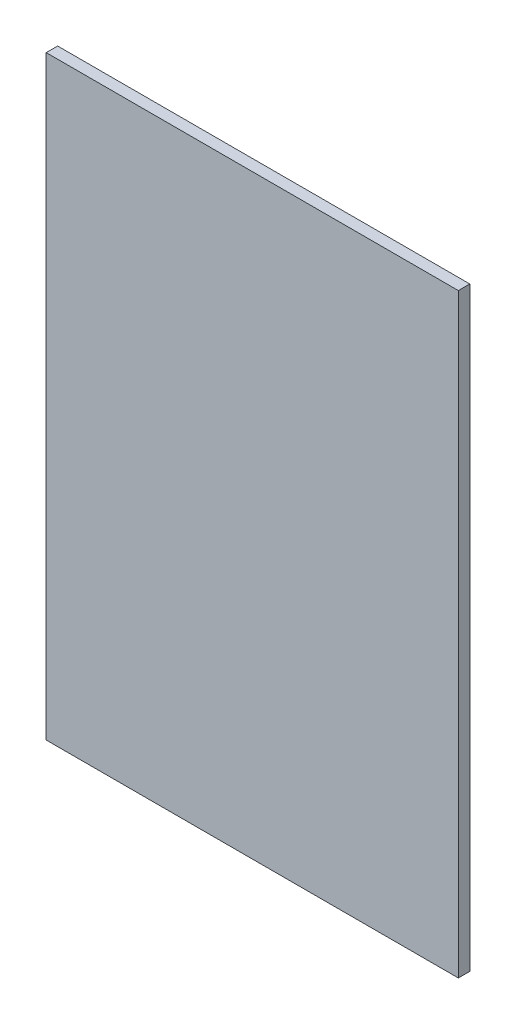
ISO-10303-21;
HEADER;
FILE_DESCRIPTION(('STEP AP214'),'2;1');
FILE_NAME('part.step','',(''),(''),'','','');
FILE_SCHEMA(('AUTOMOTIVE_DESIGN { 1 0 10303 214 1 1 1 1 }'));
ENDSEC;
DATA;
#1=APPLICATION_CONTEXT('core data for automotive mechanical design processes');
#2=APPLICATION_PROTOCOL_DEFINITION('international standard','automotive_design',2000,#1);
#3=PRODUCT_CONTEXT('',#1,'mechanical');
#4=PRODUCT('Part','Part','',(#3));
#5=PRODUCT_RELATED_PRODUCT_CATEGORY('part','',(#4));
#6=PRODUCT_DEFINITION_FORMATION('','',#4);
#7=PRODUCT_DEFINITION_CONTEXT('part definition',#1,'design');
#8=PRODUCT_DEFINITION('design','',#6,#7);
#9=PRODUCT_DEFINITION_SHAPE('','',#8);
#10=(LENGTH_UNIT() NAMED_UNIT(*) SI_UNIT(.MILLI.,.METRE.));
#11=(NAMED_UNIT(*) PLANE_ANGLE_UNIT() SI_UNIT($,.RADIAN.));
#12=(NAMED_UNIT(*) SI_UNIT($,.STERADIAN.) SOLID_ANGLE_UNIT());
#13=UNCERTAINTY_MEASURE_WITH_UNIT(LENGTH_MEASURE(1.E-05),#10,'distance_accuracy_value','');
#14=(GEOMETRIC_REPRESENTATION_CONTEXT(3) GLOBAL_UNCERTAINTY_ASSIGNED_CONTEXT((#13)) GLOBAL_UNIT_ASSIGNED_CONTEXT((#10,
#11,#12)) REPRESENTATION_CONTEXT('',''));
#15=CARTESIAN_POINT('',(0.,0.,0.));
#16=DIRECTION('',(0.,0.,1.));
#17=DIRECTION('',(1.,0.,0.));
#18=AXIS2_PLACEMENT_3D('',#15,#16,#17);
#19=CARTESIAN_POINT('',(-115.461540537581,454.408501783591,10.));
#20=DIRECTION('',(1.,0.,0.));
#21=DIRECTION('',(0.,1.,0.));
#22=AXIS2_PLACEMENT_3D('',#19,#20,#21);
#23=PLANE('',#22);
#24=DIRECTION('',(0.,-1.,0.));
#25=VECTOR('',#24,1.);
#26=CARTESIAN_POINT('',(-115.461540537581,454.408501783591,0.));
#27=LINE('',#26,#25);
#28=CARTESIAN_POINT('',(-115.461540537581,454.408501783591,0.));
#29=VERTEX_POINT('',#28);
#30=CARTESIAN_POINT('',(-115.461540537581,-65.591498216409,0.));
#31=VERTEX_POINT('',#30);
#32=EDGE_CURVE('E96',#29,#31,#27,.T.);
#33=ORIENTED_EDGE('',*,*,#32,.T.);
#34=DIRECTION('',(0.,0.,-1.));
#35=VECTOR('',#34,1.);
#36=CARTESIAN_POINT('',(-115.461540537581,-65.591498216409,10.));
#37=LINE('',#36,#35);
#38=CARTESIAN_POINT('',(-115.461540537581,-65.591498216409,10.));
#39=VERTEX_POINT('',#38);
#40=EDGE_CURVE('E11',#39,#31,#37,.T.);
#41=ORIENTED_EDGE('',*,*,#40,.F.);
#42=DIRECTION('',(0.,-1.,0.));
#43=VECTOR('',#42,1.);
#44=CARTESIAN_POINT('',(-115.461540537581,454.408501783591,10.));
#45=LINE('',#44,#43);
#46=CARTESIAN_POINT('',(-115.461540537581,454.408501783591,10.));
#47=VERTEX_POINT('',#46);
#48=EDGE_CURVE('E84',#47,#39,#45,.T.);
#49=ORIENTED_EDGE('',*,*,#48,.F.);
#50=DIRECTION('',(0.,0.,-1.));
#51=VECTOR('',#50,1.);
#52=CARTESIAN_POINT('',(-115.461540537581,454.408501783591,10.));
#53=LINE('',#52,#51);
#54=EDGE_CURVE('E92',#47,#29,#53,.T.);
#55=ORIENTED_EDGE('',*,*,#54,.T.);
#56=EDGE_LOOP('',(#33,#41,#49,#55));
#57=FACE_BOUND('',#56,.T.);
#58=ADVANCED_FACE('F33',(#57),#23,.F.);
#59=CARTESIAN_POINT('',(-115.461540537581,-65.591498216409,10.));
#60=DIRECTION('',(0.,1.,0.));
#61=DIRECTION('',(0.,0.,1.));
#62=AXIS2_PLACEMENT_3D('',#59,#60,#61);
#63=PLANE('',#62);
#64=DIRECTION('',(1.,0.,0.));
#65=VECTOR('',#64,1.);
#66=CARTESIAN_POINT('',(-115.461540537581,-65.591498216409,0.));
#67=LINE('',#66,#65);
#68=CARTESIAN_POINT('',(244.538459462419,-65.591498216409,0.));
#69=VERTEX_POINT('',#68);
#70=EDGE_CURVE('E88',#31,#69,#67,.T.);
#71=ORIENTED_EDGE('',*,*,#70,.T.);
#72=DIRECTION('',(0.,0.,-1.));
#73=VECTOR('',#72,1.);
#74=CARTESIAN_POINT('',(244.538459462419,-65.591498216409,10.));
#75=LINE('',#74,#73);
#76=CARTESIAN_POINT('',(244.538459462419,-65.591498216409,10.));
#77=VERTEX_POINT('',#76);
#78=EDGE_CURVE('E41',#77,#69,#75,.T.);
#79=ORIENTED_EDGE('',*,*,#78,.F.);
#80=DIRECTION('',(1.,0.,0.));
#81=VECTOR('',#80,1.);
#82=CARTESIAN_POINT('',(-115.461540537581,-65.591498216409,10.));
#83=LINE('',#82,#81);
#84=EDGE_CURVE('E79',#39,#77,#83,.T.);
#85=ORIENTED_EDGE('',*,*,#84,.F.);
#86=ORIENTED_EDGE('',*,*,#40,.T.);
#87=EDGE_LOOP('',(#71,#79,#85,#86));
#88=FACE_BOUND('',#87,.T.);
#89=ADVANCED_FACE('F87',(#88),#63,.F.);
#90=CARTESIAN_POINT('',(244.538459462419,454.408501783591,10.));
#91=DIRECTION('',(-1.,0.,0.));
#92=DIRECTION('',(0.,-1.,0.));
#93=AXIS2_PLACEMENT_3D('',#90,#91,#92);
#94=PLANE('',#93);
#95=DIRECTION('',(0.,1.,0.));
#96=VECTOR('',#95,1.);
#97=CARTESIAN_POINT('',(244.538459462419,454.408501783591,0.));
#98=LINE('',#97,#96);
#99=CARTESIAN_POINT('',(244.538459462419,454.408501783591,0.));
#100=VERTEX_POINT('',#99);
#101=EDGE_CURVE('E66',#69,#100,#98,.T.);
#102=ORIENTED_EDGE('',*,*,#101,.T.);
#103=DIRECTION('',(0.,0.,-1.));
#104=VECTOR('',#103,1.);
#105=CARTESIAN_POINT('',(244.538459462419,454.408501783591,10.));
#106=LINE('',#105,#104);
#107=CARTESIAN_POINT('',(244.538459462419,454.408501783591,10.));
#108=VERTEX_POINT('',#107);
#109=EDGE_CURVE('E89',#108,#100,#106,.T.);
#110=ORIENTED_EDGE('',*,*,#109,.F.);
#111=DIRECTION('',(0.,1.,0.));
#112=VECTOR('',#111,1.);
#113=CARTESIAN_POINT('',(244.538459462419,454.408501783591,10.));
#114=LINE('',#113,#112);
#115=EDGE_CURVE('E82',#77,#108,#114,.T.);
#116=ORIENTED_EDGE('',*,*,#115,.F.);
#117=ORIENTED_EDGE('',*,*,#78,.T.);
#118=EDGE_LOOP('',(#102,#110,#116,#117));
#119=FACE_BOUND('',#118,.T.);
#120=ADVANCED_FACE('F90',(#119),#94,.F.);
#121=CARTESIAN_POINT('',(-115.461540537581,454.408501783591,10.));
#122=DIRECTION('',(0.,-1.,0.));
#123=DIRECTION('',(0.,0.,-1.));
#124=AXIS2_PLACEMENT_3D('',#121,#122,#123);
#125=PLANE('',#124);
#126=DIRECTION('',(-1.,0.,0.));
#127=VECTOR('',#126,1.);
#128=CARTESIAN_POINT('',(-115.461540537581,454.408501783591,0.));
#129=LINE('',#128,#127);
#130=EDGE_CURVE('E72',#100,#29,#129,.T.);
#131=ORIENTED_EDGE('',*,*,#130,.T.);
#132=ORIENTED_EDGE('',*,*,#54,.F.);
#133=DIRECTION('',(-1.,0.,0.));
#134=VECTOR('',#133,1.);
#135=CARTESIAN_POINT('',(-115.461540537581,454.408501783591,10.));
#136=LINE('',#135,#134);
#137=EDGE_CURVE('E49',#108,#47,#136,.T.);
#138=ORIENTED_EDGE('',*,*,#137,.F.);
#139=ORIENTED_EDGE('',*,*,#109,.T.);
#140=EDGE_LOOP('',(#131,#132,#138,#139));
#141=FACE_BOUND('',#140,.T.);
#142=ADVANCED_FACE('F103',(#141),#125,.F.);
#143=CARTESIAN_POINT('',(0.,0.,10.));
#144=DIRECTION('',(0.,0.,1.));
#145=DIRECTION('',(1.,0.,0.));
#146=AXIS2_PLACEMENT_3D('',#143,#144,#145);
#147=PLANE('',#146);
#148=ORIENTED_EDGE('',*,*,#48,.T.);
#149=ORIENTED_EDGE('',*,*,#84,.T.);
#150=ORIENTED_EDGE('',*,*,#115,.T.);
#151=ORIENTED_EDGE('',*,*,#137,.T.);
#152=EDGE_LOOP('',(#148,#149,#150,#151));
#153=FACE_BOUND('',#152,.T.);
#154=ADVANCED_FACE('F80',(#153),#147,.T.);
#155=CARTESIAN_POINT('',(0.,0.,0.));
#156=DIRECTION('',(0.,0.,1.));
#157=DIRECTION('',(1.,0.,0.));
#158=AXIS2_PLACEMENT_3D('',#155,#156,#157);
#159=PLANE('',#158);
#160=ORIENTED_EDGE('',*,*,#32,.F.);
#161=ORIENTED_EDGE('',*,*,#130,.F.);
#162=ORIENTED_EDGE('',*,*,#101,.F.);
#163=ORIENTED_EDGE('',*,*,#70,.F.);
#164=EDGE_LOOP('',(#160,#161,#162,#163));
#165=FACE_BOUND('',#164,.T.);
#166=ADVANCED_FACE('F106',(#165),#159,.F.);
#167=CLOSED_SHELL('',(#58,#89,#120,#142,#154,#166));
#168=MANIFOLD_SOLID_BREP('B2',#167);
#169=ADVANCED_BREP_SHAPE_REPRESENTATION('',(#18,#168),#14);
#170=SHAPE_DEFINITION_REPRESENTATION(#9,#169);
ENDSEC;
END-ISO-10303-21;
